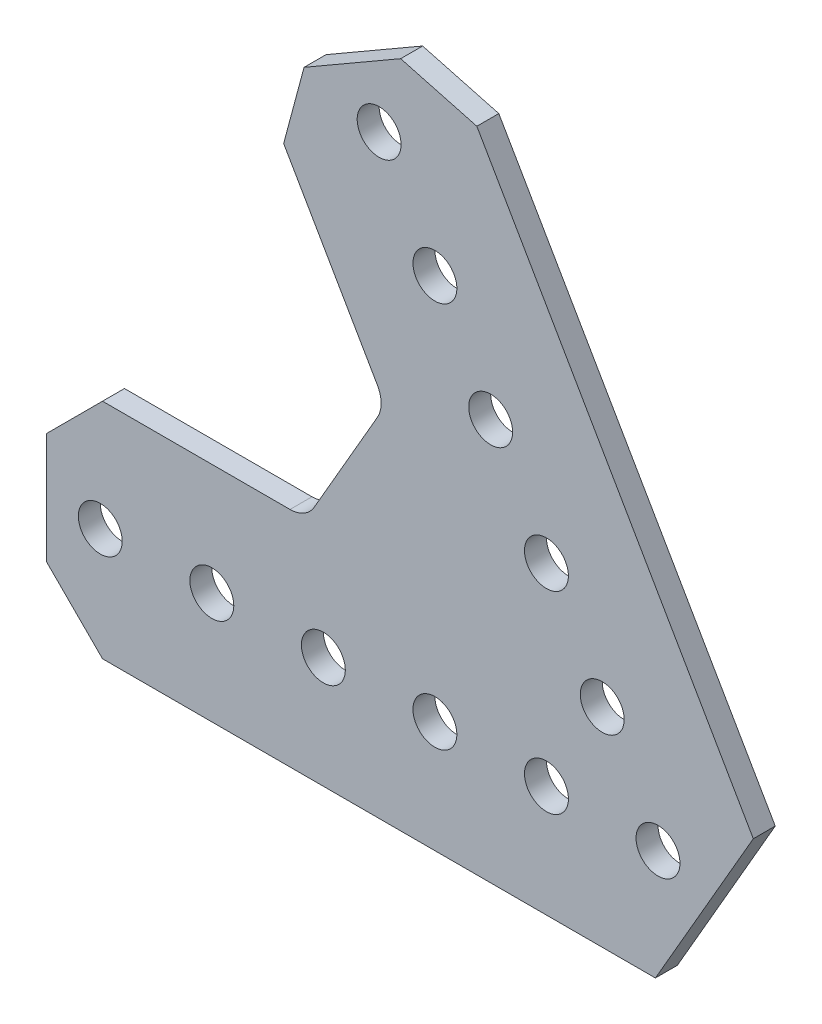
ISO-10303-21;
HEADER;
FILE_DESCRIPTION(('STEP AP214'),'2;1');
FILE_NAME('part.step','',(''),(''),'','','');
FILE_SCHEMA(('AUTOMOTIVE_DESIGN { 1 0 10303 214 1 1 1 1 }'));
ENDSEC;
DATA;
#1=APPLICATION_CONTEXT('core data for automotive mechanical design processes');
#2=APPLICATION_PROTOCOL_DEFINITION('international standard','automotive_design',2000,#1);
#3=PRODUCT_CONTEXT('',#1,'mechanical');
#4=PRODUCT('Part','Part','',(#3));
#5=PRODUCT_RELATED_PRODUCT_CATEGORY('part','',(#4));
#6=PRODUCT_DEFINITION_FORMATION('','',#4);
#7=PRODUCT_DEFINITION_CONTEXT('part definition',#1,'design');
#8=PRODUCT_DEFINITION('design','',#6,#7);
#9=PRODUCT_DEFINITION_SHAPE('','',#8);
#10=(LENGTH_UNIT() NAMED_UNIT(*) SI_UNIT(.MILLI.,.METRE.));
#11=(NAMED_UNIT(*) PLANE_ANGLE_UNIT() SI_UNIT($,.RADIAN.));
#12=(NAMED_UNIT(*) SI_UNIT($,.STERADIAN.) SOLID_ANGLE_UNIT());
#13=UNCERTAINTY_MEASURE_WITH_UNIT(LENGTH_MEASURE(1.E-05),#10,'distance_accuracy_value','');
#14=(GEOMETRIC_REPRESENTATION_CONTEXT(3) GLOBAL_UNCERTAINTY_ASSIGNED_CONTEXT((#13)) GLOBAL_UNIT_ASSIGNED_CONTEXT((#10,
#11,#12)) REPRESENTATION_CONTEXT('',''));
#15=CARTESIAN_POINT('',(0.,0.,0.));
#16=DIRECTION('',(0.,0.,1.));
#17=DIRECTION('',(1.,0.,0.));
#18=AXIS2_PLACEMENT_3D('',#15,#16,#17);
#19=CARTESIAN_POINT('',(10.8518756596882,6.604,1.25));
#20=DIRECTION('',(0.866025403784439,-0.499999999999999,0.));
#21=DIRECTION('',(0.499999999999999,0.866025403784439,0.));
#22=AXIS2_PLACEMENT_3D('',#19,#20,#21);
#23=PLANE('',#22);
#24=DIRECTION('',(-0.499999999999999,-0.866025403784439,0.));
#25=VECTOR('',#24,1.);
#26=CARTESIAN_POINT('',(10.8518756596882,6.604,-1.25));
#27=LINE('',#26,#25);
#28=CARTESIAN_POINT('',(10.8518756596882,6.604,-1.25));
#29=VERTEX_POINT('',#28);
#30=CARTESIAN_POINT('',(-0.293293936748299,-12.7,-1.25));
#31=VERTEX_POINT('',#30);
#32=EDGE_CURVE('E184',#29,#31,#27,.T.);
#33=ORIENTED_EDGE('',*,*,#32,.F.);
#34=DIRECTION('',(0.,0.,-1.));
#35=VECTOR('',#34,1.);
#36=CARTESIAN_POINT('',(10.8518756596882,6.604,1.25));
#37=LINE('',#36,#35);
#38=CARTESIAN_POINT('',(10.8518756596882,6.604,1.25));
#39=VERTEX_POINT('',#38);
#40=EDGE_CURVE('E11',#39,#29,#37,.T.);
#41=ORIENTED_EDGE('',*,*,#40,.F.);
#42=DIRECTION('',(-0.499999999999999,-0.866025403784439,0.));
#43=VECTOR('',#42,1.);
#44=CARTESIAN_POINT('',(10.8518756596882,6.604,1.25));
#45=LINE('',#44,#43);
#46=CARTESIAN_POINT('',(-0.293293936748299,-12.7,1.25));
#47=VERTEX_POINT('',#46);
#48=EDGE_CURVE('E237',#39,#47,#45,.T.);
#49=ORIENTED_EDGE('',*,*,#48,.T.);
#50=DIRECTION('',(0.,0.,-1.));
#51=VECTOR('',#50,1.);
#52=CARTESIAN_POINT('',(-0.293293936748299,-12.7,1.25));
#53=LINE('',#52,#51);
#54=EDGE_CURVE('E48',#47,#31,#53,.T.);
#55=ORIENTED_EDGE('',*,*,#54,.T.);
#56=EDGE_LOOP('',(#33,#41,#49,#55));
#57=FACE_BOUND('',#56,.T.);
#58=ADVANCED_FACE('F45',(#57),#23,.T.);
#59=CARTESIAN_POINT('',(-20.624477371938,61.1226426877505,1.25));
#60=DIRECTION('',(0.866025403784436,0.500000000000004,0.));
#61=DIRECTION('',(-0.500000000000005,0.866025403784436,0.));
#62=AXIS2_PLACEMENT_3D('',#59,#60,#61);
#63=PLANE('',#62);
#64=DIRECTION('',(0.500000000000004,-0.866025403784436,0.));
#65=VECTOR('',#64,1.);
#66=CARTESIAN_POINT('',(-20.624477371938,61.1226426877505,-1.25));
#67=LINE('',#66,#65);
#68=CARTESIAN_POINT('',(-20.624477371938,61.1226426877505,-1.25));
#69=VERTEX_POINT('',#68);
#70=EDGE_CURVE('E234',#69,#29,#67,.T.);
#71=ORIENTED_EDGE('',*,*,#70,.F.);
#72=DIRECTION('',(0.,0.,-1.));
#73=VECTOR('',#72,1.);
#74=CARTESIAN_POINT('',(-20.624477371938,61.1226426877505,1.25));
#75=LINE('',#74,#73);
#76=CARTESIAN_POINT('',(-20.624477371938,61.1226426877505,1.25));
#77=VERTEX_POINT('',#76);
#78=EDGE_CURVE('E55',#77,#69,#75,.T.);
#79=ORIENTED_EDGE('',*,*,#78,.F.);
#80=DIRECTION('',(0.500000000000004,-0.866025403784436,0.));
#81=VECTOR('',#80,1.);
#82=CARTESIAN_POINT('',(-20.624477371938,61.1226426877505,1.25));
#83=LINE('',#82,#81);
#84=EDGE_CURVE('E170',#77,#39,#83,.T.);
#85=ORIENTED_EDGE('',*,*,#84,.T.);
#86=ORIENTED_EDGE('',*,*,#40,.T.);
#87=EDGE_LOOP('',(#71,#79,#85,#86));
#88=FACE_BOUND('',#87,.T.);
#89=ADVANCED_FACE('F273',(#88),#63,.T.);
#90=CARTESIAN_POINT('',(-29.2987386859691,63.4469040017817,1.25));
#91=DIRECTION('',(0.258819045102523,0.965925826289068,0.));
#92=DIRECTION('',(-0.965925826289068,0.258819045102523,0.));
#93=AXIS2_PLACEMENT_3D('',#90,#91,#92);
#94=PLANE('',#93);
#95=DIRECTION('',(0.965925826289068,-0.258819045102523,0.));
#96=VECTOR('',#95,1.);
#97=CARTESIAN_POINT('',(-29.2987386859691,63.4469040017817,-1.25));
#98=LINE('',#97,#96);
#99=CARTESIAN_POINT('',(-29.2987386859691,63.4469040017817,-1.25));
#100=VERTEX_POINT('',#99);
#101=EDGE_CURVE('E156',#100,#69,#98,.T.);
#102=ORIENTED_EDGE('',*,*,#101,.F.);
#103=DIRECTION('',(0.,0.,-1.));
#104=VECTOR('',#103,1.);
#105=CARTESIAN_POINT('',(-29.2987386859691,63.4469040017817,1.25));
#106=LINE('',#105,#104);
#107=CARTESIAN_POINT('',(-29.2987386859691,63.4469040017817,1.25));
#108=VERTEX_POINT('',#107);
#109=EDGE_CURVE('E151',#108,#100,#106,.T.);
#110=ORIENTED_EDGE('',*,*,#109,.F.);
#111=DIRECTION('',(0.965925826289068,-0.258819045102523,0.));
#112=VECTOR('',#111,1.);
#113=CARTESIAN_POINT('',(-29.2987386859691,63.4469040017817,1.25));
#114=LINE('',#113,#112);
#115=EDGE_CURVE('E154',#108,#77,#114,.T.);
#116=ORIENTED_EDGE('',*,*,#115,.T.);
#117=ORIENTED_EDGE('',*,*,#78,.T.);
#118=EDGE_LOOP('',(#102,#110,#116,#117));
#119=FACE_BOUND('',#118,.T.);
#120=ADVANCED_FACE('F153',(#119),#94,.T.);
#121=CARTESIAN_POINT('',(-40.2972613140314,57.0969040017816,1.25));
#122=DIRECTION('',(-0.500000000000007,0.866025403784435,0.));
#123=DIRECTION('',(-0.866025403784435,-0.500000000000007,0.));
#124=AXIS2_PLACEMENT_3D('',#121,#122,#123);
#125=PLANE('',#124);
#126=DIRECTION('',(0.866025403784435,0.500000000000007,0.));
#127=VECTOR('',#126,1.);
#128=CARTESIAN_POINT('',(-40.2972613140314,57.0969040017816,-1.25));
#129=LINE('',#128,#127);
#130=CARTESIAN_POINT('',(-40.2972613140314,57.0969040017816,-1.25));
#131=VERTEX_POINT('',#130);
#132=EDGE_CURVE('E229',#131,#100,#129,.T.);
#133=ORIENTED_EDGE('',*,*,#132,.F.);
#134=DIRECTION('',(0.,0.,-1.));
#135=VECTOR('',#134,1.);
#136=CARTESIAN_POINT('',(-40.2972613140314,57.0969040017816,1.25));
#137=LINE('',#136,#135);
#138=CARTESIAN_POINT('',(-40.2972613140314,57.0969040017816,1.25));
#139=VERTEX_POINT('',#138);
#140=EDGE_CURVE('E162',#139,#131,#137,.T.);
#141=ORIENTED_EDGE('',*,*,#140,.F.);
#142=DIRECTION('',(0.866025403784435,0.500000000000007,0.));
#143=VECTOR('',#142,1.);
#144=CARTESIAN_POINT('',(-40.2972613140314,57.0969040017816,1.25));
#145=LINE('',#144,#143);
#146=EDGE_CURVE('E168',#139,#108,#145,.T.);
#147=ORIENTED_EDGE('',*,*,#146,.T.);
#148=ORIENTED_EDGE('',*,*,#109,.T.);
#149=EDGE_LOOP('',(#133,#141,#147,#148));
#150=FACE_BOUND('',#149,.T.);
#151=ADVANCED_FACE('F173',(#150),#125,.T.);
#152=CARTESIAN_POINT('',(-42.6215226280626,48.4226426877505,1.25));
#153=DIRECTION('',(-0.965925826289069,0.25881904510252,0.));
#154=DIRECTION('',(-0.25881904510252,-0.965925826289069,0.));
#155=AXIS2_PLACEMENT_3D('',#152,#153,#154);
#156=PLANE('',#155);
#157=DIRECTION('',(0.25881904510252,0.965925826289069,0.));
#158=VECTOR('',#157,1.);
#159=CARTESIAN_POINT('',(-42.6215226280626,48.4226426877505,-1.25));
#160=LINE('',#159,#158);
#161=CARTESIAN_POINT('',(-42.6215226280626,48.4226426877505,-1.25));
#162=VERTEX_POINT('',#161);
#163=EDGE_CURVE('E225',#162,#131,#160,.T.);
#164=ORIENTED_EDGE('',*,*,#163,.F.);
#165=DIRECTION('',(0.,0.,-1.));
#166=VECTOR('',#165,1.);
#167=CARTESIAN_POINT('',(-42.6215226280626,48.4226426877505,1.25));
#168=LINE('',#167,#166);
#169=CARTESIAN_POINT('',(-42.6215226280626,48.4226426877505,1.25));
#170=VERTEX_POINT('',#169);
#171=EDGE_CURVE('E243',#170,#162,#168,.T.);
#172=ORIENTED_EDGE('',*,*,#171,.F.);
#173=DIRECTION('',(0.25881904510252,0.965925826289069,0.));
#174=VECTOR('',#173,1.);
#175=CARTESIAN_POINT('',(-42.6215226280626,48.4226426877505,1.25));
#176=LINE('',#175,#174);
#177=EDGE_CURVE('E175',#170,#139,#176,.T.);
#178=ORIENTED_EDGE('',*,*,#177,.T.);
#179=ORIENTED_EDGE('',*,*,#140,.T.);
#180=EDGE_LOOP('',(#164,#172,#178,#179));
#181=FACE_BOUND('',#180,.T.);
#182=ADVANCED_FACE('F286',(#181),#156,.T.);
#183=CARTESIAN_POINT('',(-31.9474145991094,29.9345452561247,1.25));
#184=DIRECTION('',(-0.866025403784437,-0.500000000000002,0.));
#185=DIRECTION('',(0.500000000000002,-0.866025403784438,0.));
#186=AXIS2_PLACEMENT_3D('',#183,#184,#185);
#187=PLANE('',#186);
#188=DIRECTION('',(-0.500000000000002,0.866025403784437,0.));
#189=VECTOR('',#188,1.);
#190=CARTESIAN_POINT('',(-31.9474145991094,29.9345452561247,-1.25));
#191=LINE('',#190,#189);
#192=CARTESIAN_POINT('',(-31.9474145991094,29.9345452561247,-1.25));
#193=VERTEX_POINT('',#192);
#194=EDGE_CURVE('E221',#193,#162,#191,.T.);
#195=ORIENTED_EDGE('',*,*,#194,.F.);
#196=DIRECTION('',(0.,0.,-1.));
#197=VECTOR('',#196,1.);
#198=CARTESIAN_POINT('',(-31.9474145991094,29.9345452561247,1.25));
#199=LINE('',#198,#197);
#200=CARTESIAN_POINT('',(-31.9474145991094,29.9345452561247,1.25));
#201=VERTEX_POINT('',#200);
#202=EDGE_CURVE('E246',#201,#193,#199,.T.);
#203=ORIENTED_EDGE('',*,*,#202,.F.);
#204=DIRECTION('',(-0.500000000000002,0.866025403784437,0.));
#205=VECTOR('',#204,1.);
#206=CARTESIAN_POINT('',(-31.9474145991094,29.9345452561247,1.25));
#207=LINE('',#206,#205);
#208=EDGE_CURVE('E178',#201,#170,#207,.T.);
#209=ORIENTED_EDGE('',*,*,#208,.T.);
#210=ORIENTED_EDGE('',*,*,#171,.T.);
#211=EDGE_LOOP('',(#195,#203,#209,#210));
#212=FACE_BOUND('',#211,.T.);
#213=ADVANCED_FACE('F289',(#212),#187,.T.);
#214=CARTESIAN_POINT('',(-34.6970452561249,28.3470452561247,1.25));
#215=DIRECTION('',(0.,0.,-1.));
#216=DIRECTION('',(-1.,0.,0.));
#217=AXIS2_PLACEMENT_3D('',#214,#215,#216);
#218=CYLINDRICAL_SURFACE('',#217,3.17499999999999);
#219=CARTESIAN_POINT('',(-34.6970452561249,28.3470452561247,-1.25));
#220=DIRECTION('',(0.,0.,1.));
#221=DIRECTION('',(1.,0.,0.));
#222=AXIS2_PLACEMENT_3D('',#219,#220,#221);
#223=CIRCLE('',#222,3.17499999999999);
#224=CARTESIAN_POINT('',(-31.9474145991093,26.7595452561247,-1.25));
#225=VERTEX_POINT('',#224);
#226=EDGE_CURVE('E217',#225,#193,#223,.T.);
#227=ORIENTED_EDGE('',*,*,#226,.F.);
#228=DIRECTION('',(0.,0.,-1.));
#229=VECTOR('',#228,1.);
#230=CARTESIAN_POINT('',(-31.9474145991093,26.7595452561247,1.25));
#231=LINE('',#230,#229);
#232=CARTESIAN_POINT('',(-31.9474145991093,26.7595452561247,1.25));
#233=VERTEX_POINT('',#232);
#234=EDGE_CURVE('E249',#233,#225,#231,.T.);
#235=ORIENTED_EDGE('',*,*,#234,.F.);
#236=CARTESIAN_POINT('',(-34.6970452561249,28.3470452561247,1.25));
#237=DIRECTION('',(0.,0.,1.));
#238=DIRECTION('',(1.,0.,0.));
#239=AXIS2_PLACEMENT_3D('',#236,#237,#238);
#240=CIRCLE('',#239,3.17499999999999);
#241=EDGE_CURVE('E497',#233,#201,#240,.T.);
#242=ORIENTED_EDGE('',*,*,#241,.T.);
#243=ORIENTED_EDGE('',*,*,#202,.T.);
#244=EDGE_LOOP('',(#227,#235,#242,#243));
#245=FACE_BOUND('',#244,.T.);
#246=ADVANCED_FACE('F293',(#245),#218,.F.);
#247=CARTESIAN_POINT('',(-39.148153285078,14.2875,1.25));
#248=DIRECTION('',(-0.866025403784441,0.499999999999996,0.));
#249=DIRECTION('',(-0.499999999999996,-0.866025403784441,0.));
#250=AXIS2_PLACEMENT_3D('',#247,#248,#249);
#251=PLANE('',#250);
#252=DIRECTION('',(0.499999999999996,0.866025403784441,0.));
#253=VECTOR('',#252,1.);
#254=CARTESIAN_POINT('',(-39.148153285078,14.2875,-1.25));
#255=LINE('',#254,#253);
#256=CARTESIAN_POINT('',(-39.148153285078,14.2875,-1.25));
#257=VERTEX_POINT('',#256);
#258=EDGE_CURVE('E213',#257,#225,#255,.T.);
#259=ORIENTED_EDGE('',*,*,#258,.F.);
#260=DIRECTION('',(0.,0.,-1.));
#261=VECTOR('',#260,1.);
#262=CARTESIAN_POINT('',(-39.148153285078,14.2875,1.25));
#263=LINE('',#262,#261);
#264=CARTESIAN_POINT('',(-39.148153285078,14.2875,1.25));
#265=VERTEX_POINT('',#264);
#266=EDGE_CURVE('E252',#265,#257,#263,.T.);
#267=ORIENTED_EDGE('',*,*,#266,.F.);
#268=DIRECTION('',(0.499999999999996,0.866025403784441,0.));
#269=VECTOR('',#268,1.);
#270=CARTESIAN_POINT('',(-39.148153285078,14.2875,1.25));
#271=LINE('',#270,#269);
#272=EDGE_CURVE('E493',#265,#233,#271,.T.);
#273=ORIENTED_EDGE('',*,*,#272,.T.);
#274=ORIENTED_EDGE('',*,*,#234,.T.);
#275=EDGE_LOOP('',(#259,#267,#273,#274));
#276=FACE_BOUND('',#275,.T.);
#277=ADVANCED_FACE('F297',(#276),#251,.T.);
#278=CARTESIAN_POINT('',(-41.8977839420936,15.875,1.25));
#279=DIRECTION('',(0.,0.,-1.));
#280=DIRECTION('',(-1.,0.,0.));
#281=AXIS2_PLACEMENT_3D('',#278,#279,#280);
#282=CYLINDRICAL_SURFACE('',#281,3.175);
#283=CARTESIAN_POINT('',(-41.8977839420936,15.875,-1.25));
#284=DIRECTION('',(0.,0.,1.));
#285=DIRECTION('',(1.,0.,0.));
#286=AXIS2_PLACEMENT_3D('',#283,#284,#285);
#287=CIRCLE('',#286,3.175);
#288=CARTESIAN_POINT('',(-41.8977839420936,12.7,-1.25));
#289=VERTEX_POINT('',#288);
#290=EDGE_CURVE('E209',#289,#257,#287,.T.);
#291=ORIENTED_EDGE('',*,*,#290,.F.);
#292=DIRECTION('',(0.,0.,-1.));
#293=VECTOR('',#292,1.);
#294=CARTESIAN_POINT('',(-41.8977839420936,12.7,1.25));
#295=LINE('',#294,#293);
#296=CARTESIAN_POINT('',(-41.8977839420936,12.7,1.25));
#297=VERTEX_POINT('',#296);
#298=EDGE_CURVE('E255',#297,#289,#295,.T.);
#299=ORIENTED_EDGE('',*,*,#298,.F.);
#300=CARTESIAN_POINT('',(-41.8977839420936,15.875,1.25));
#301=DIRECTION('',(0.,0.,1.));
#302=DIRECTION('',(1.,0.,0.));
#303=AXIS2_PLACEMENT_3D('',#300,#301,#302);
#304=CIRCLE('',#303,3.175);
#305=EDGE_CURVE('E489',#297,#265,#304,.T.);
#306=ORIENTED_EDGE('',*,*,#305,.T.);
#307=ORIENTED_EDGE('',*,*,#266,.T.);
#308=EDGE_LOOP('',(#291,#299,#306,#307));
#309=FACE_BOUND('',#308,.T.);
#310=ADVANCED_FACE('F301',(#309),#282,.F.);
#311=CARTESIAN_POINT('',(-63.246,12.7,1.25));
#312=DIRECTION('',(0.,1.,0.));
#313=DIRECTION('',(0.,0.,1.));
#314=AXIS2_PLACEMENT_3D('',#311,#312,#313);
#315=PLANE('',#314);
#316=DIRECTION('',(1.,0.,0.));
#317=VECTOR('',#316,1.);
#318=CARTESIAN_POINT('',(-63.246,12.7,-1.25));
#319=LINE('',#318,#317);
#320=CARTESIAN_POINT('',(-63.246,12.7,-1.25));
#321=VERTEX_POINT('',#320);
#322=EDGE_CURVE('E205',#321,#289,#319,.T.);
#323=ORIENTED_EDGE('',*,*,#322,.F.);
#324=DIRECTION('',(0.,0.,-1.));
#325=VECTOR('',#324,1.);
#326=CARTESIAN_POINT('',(-63.246,12.7,1.25));
#327=LINE('',#326,#325);
#328=CARTESIAN_POINT('',(-63.246,12.7,1.25));
#329=VERTEX_POINT('',#328);
#330=EDGE_CURVE('E258',#329,#321,#327,.T.);
#331=ORIENTED_EDGE('',*,*,#330,.F.);
#332=DIRECTION('',(1.,0.,0.));
#333=VECTOR('',#332,1.);
#334=CARTESIAN_POINT('',(-63.246,12.7,1.25));
#335=LINE('',#334,#333);
#336=EDGE_CURVE('E485',#329,#297,#335,.T.);
#337=ORIENTED_EDGE('',*,*,#336,.T.);
#338=ORIENTED_EDGE('',*,*,#298,.T.);
#339=EDGE_LOOP('',(#323,#331,#337,#338));
#340=FACE_BOUND('',#339,.T.);
#341=ADVANCED_FACE('F305',(#340),#315,.T.);
#342=CARTESIAN_POINT('',(-69.596,6.35,1.25));
#343=DIRECTION('',(-0.707106781186547,0.707106781186548,0.));
#344=DIRECTION('',(-0.707106781186548,-0.707106781186547,0.));
#345=AXIS2_PLACEMENT_3D('',#342,#343,#344);
#346=PLANE('',#345);
#347=DIRECTION('',(0.707106781186548,0.707106781186547,0.));
#348=VECTOR('',#347,1.);
#349=CARTESIAN_POINT('',(-69.596,6.35,-1.25));
#350=LINE('',#349,#348);
#351=CARTESIAN_POINT('',(-69.596,6.35,-1.25));
#352=VERTEX_POINT('',#351);
#353=EDGE_CURVE('E201',#352,#321,#350,.T.);
#354=ORIENTED_EDGE('',*,*,#353,.F.);
#355=DIRECTION('',(0.,0.,-1.));
#356=VECTOR('',#355,1.);
#357=CARTESIAN_POINT('',(-69.596,6.35,1.25));
#358=LINE('',#357,#356);
#359=CARTESIAN_POINT('',(-69.596,6.35,1.25));
#360=VERTEX_POINT('',#359);
#361=EDGE_CURVE('E261',#360,#352,#358,.T.);
#362=ORIENTED_EDGE('',*,*,#361,.F.);
#363=DIRECTION('',(0.707106781186548,0.707106781186547,0.));
#364=VECTOR('',#363,1.);
#365=CARTESIAN_POINT('',(-69.596,6.35,1.25));
#366=LINE('',#365,#364);
#367=EDGE_CURVE('E481',#360,#329,#366,.T.);
#368=ORIENTED_EDGE('',*,*,#367,.T.);
#369=ORIENTED_EDGE('',*,*,#330,.T.);
#370=EDGE_LOOP('',(#354,#362,#368,#369));
#371=FACE_BOUND('',#370,.T.);
#372=ADVANCED_FACE('F309',(#371),#346,.T.);
#373=CARTESIAN_POINT('',(-69.596,-6.35,1.25));
#374=DIRECTION('',(-1.,0.,0.));
#375=DIRECTION('',(0.,0.,1.));
#376=AXIS2_PLACEMENT_3D('',#373,#374,#375);
#377=PLANE('',#376);
#378=DIRECTION('',(0.,1.,0.));
#379=VECTOR('',#378,1.);
#380=CARTESIAN_POINT('',(-69.596,-6.35,-1.25));
#381=LINE('',#380,#379);
#382=CARTESIAN_POINT('',(-69.596,-6.35,-1.25));
#383=VERTEX_POINT('',#382);
#384=EDGE_CURVE('E197',#383,#352,#381,.T.);
#385=ORIENTED_EDGE('',*,*,#384,.F.);
#386=DIRECTION('',(0.,0.,-1.));
#387=VECTOR('',#386,1.);
#388=CARTESIAN_POINT('',(-69.596,-6.35,1.25));
#389=LINE('',#388,#387);
#390=CARTESIAN_POINT('',(-69.596,-6.35,1.25));
#391=VERTEX_POINT('',#390);
#392=EDGE_CURVE('E264',#391,#383,#389,.T.);
#393=ORIENTED_EDGE('',*,*,#392,.F.);
#394=DIRECTION('',(0.,1.,0.));
#395=VECTOR('',#394,1.);
#396=CARTESIAN_POINT('',(-69.596,-6.35,1.25));
#397=LINE('',#396,#395);
#398=EDGE_CURVE('E477',#391,#360,#397,.T.);
#399=ORIENTED_EDGE('',*,*,#398,.T.);
#400=ORIENTED_EDGE('',*,*,#361,.T.);
#401=EDGE_LOOP('',(#385,#393,#399,#400));
#402=FACE_BOUND('',#401,.T.);
#403=ADVANCED_FACE('F313',(#402),#377,.T.);
#404=CARTESIAN_POINT('',(-63.246,-12.7,1.25));
#405=DIRECTION('',(-0.707106781186547,-0.707106781186548,0.));
#406=DIRECTION('',(0.707106781186548,-0.707106781186547,0.));
#407=AXIS2_PLACEMENT_3D('',#404,#405,#406);
#408=PLANE('',#407);
#409=DIRECTION('',(-0.707106781186548,0.707106781186547,0.));
#410=VECTOR('',#409,1.);
#411=CARTESIAN_POINT('',(-63.246,-12.7,-1.25));
#412=LINE('',#411,#410);
#413=CARTESIAN_POINT('',(-63.246,-12.7,-1.25));
#414=VERTEX_POINT('',#413);
#415=EDGE_CURVE('E193',#414,#383,#412,.T.);
#416=ORIENTED_EDGE('',*,*,#415,.F.);
#417=DIRECTION('',(0.,0.,-1.));
#418=VECTOR('',#417,1.);
#419=CARTESIAN_POINT('',(-63.246,-12.7,1.25));
#420=LINE('',#419,#418);
#421=CARTESIAN_POINT('',(-63.246,-12.7,1.25));
#422=VERTEX_POINT('',#421);
#423=EDGE_CURVE('E266',#422,#414,#420,.T.);
#424=ORIENTED_EDGE('',*,*,#423,.F.);
#425=DIRECTION('',(-0.707106781186548,0.707106781186547,0.));
#426=VECTOR('',#425,1.);
#427=CARTESIAN_POINT('',(-63.246,-12.7,1.25));
#428=LINE('',#427,#426);
#429=EDGE_CURVE('E473',#422,#391,#428,.T.);
#430=ORIENTED_EDGE('',*,*,#429,.T.);
#431=ORIENTED_EDGE('',*,*,#392,.T.);
#432=EDGE_LOOP('',(#416,#424,#430,#431));
#433=FACE_BOUND('',#432,.T.);
#434=ADVANCED_FACE('F317',(#433),#408,.T.);
#435=CARTESIAN_POINT('',(-0.293293936748299,-12.7,1.25));
#436=DIRECTION('',(0.,-1.,0.));
#437=DIRECTION('',(0.,0.,-1.));
#438=AXIS2_PLACEMENT_3D('',#435,#436,#437);
#439=PLANE('',#438);
#440=DIRECTION('',(-1.,0.,0.));
#441=VECTOR('',#440,1.);
#442=CARTESIAN_POINT('',(-0.293293936748299,-12.7,-1.25));
#443=LINE('',#442,#441);
#444=EDGE_CURVE('E188',#31,#414,#443,.T.);
#445=ORIENTED_EDGE('',*,*,#444,.F.);
#446=ORIENTED_EDGE('',*,*,#54,.F.);
#447=DIRECTION('',(-1.,0.,0.));
#448=VECTOR('',#447,1.);
#449=CARTESIAN_POINT('',(-0.293293936748299,-12.7,1.25));
#450=LINE('',#449,#448);
#451=EDGE_CURVE('E470',#47,#422,#450,.T.);
#452=ORIENTED_EDGE('',*,*,#451,.T.);
#453=ORIENTED_EDGE('',*,*,#423,.T.);
#454=EDGE_LOOP('',(#445,#446,#452,#453));
#455=FACE_BOUND('',#454,.T.);
#456=ADVANCED_FACE('F270',(#455),#439,.T.);
#457=CARTESIAN_POINT('',(-41.8977839420936,15.875,1.25));
#458=DIRECTION('',(0.,0.,1.));
#459=DIRECTION('',(1.,0.,0.));
#460=AXIS2_PLACEMENT_3D('',#457,#458,#459);
#461=PLANE('',#460);
#462=CARTESIAN_POINT('',(-6.3499999999998,10.9985226280625,1.25));
#463=DIRECTION('',(0.,0.,-1.));
#464=DIRECTION('',(1.,0.,0.));
#465=AXIS2_PLACEMENT_3D('',#462,#463,#464);
#466=CIRCLE('',#465,2.5);
#467=CARTESIAN_POINT('',(-3.8499999999998,10.9985226280625,1.25));
#468=VERTEX_POINT('',#467);
#469=EDGE_CURVE('E380',#468,#468,#466,.T.);
#470=ORIENTED_EDGE('',*,*,#469,.T.);
#471=EDGE_LOOP('',(#470));
#472=FACE_BOUND('',#471,.T.);
#473=CARTESIAN_POINT('',(-12.6999999999998,21.9970452561248,1.25));
#474=DIRECTION('',(0.,0.,-1.));
#475=DIRECTION('',(1.,0.,0.));
#476=AXIS2_PLACEMENT_3D('',#473,#474,#475);
#477=CIRCLE('',#476,2.5);
#478=CARTESIAN_POINT('',(-10.1999999999998,21.9970452561248,1.25));
#479=VERTEX_POINT('',#478);
#480=EDGE_CURVE('E390',#479,#479,#477,.T.);
#481=ORIENTED_EDGE('',*,*,#480,.T.);
#482=EDGE_LOOP('',(#481));
#483=FACE_BOUND('',#482,.T.);
#484=CARTESIAN_POINT('',(-19.05,32.9955678841872,1.25));
#485=DIRECTION('',(0.,0.,-1.));
#486=DIRECTION('',(1.,0.,0.));
#487=AXIS2_PLACEMENT_3D('',#484,#485,#486);
#488=CIRCLE('',#487,2.5);
#489=CARTESIAN_POINT('',(-16.55,32.9955678841872,1.25));
#490=VERTEX_POINT('',#489);
#491=EDGE_CURVE('E398',#490,#490,#488,.T.);
#492=ORIENTED_EDGE('',*,*,#491,.T.);
#493=EDGE_LOOP('',(#492));
#494=FACE_BOUND('',#493,.T.);
#495=CARTESIAN_POINT('',(-25.4,43.9940905122495,1.25));
#496=DIRECTION('',(0.,0.,-1.));
#497=DIRECTION('',(1.,0.,0.));
#498=AXIS2_PLACEMENT_3D('',#495,#496,#497);
#499=CIRCLE('',#498,2.5);
#500=CARTESIAN_POINT('',(-22.9,43.9940905122495,1.25));
#501=VERTEX_POINT('',#500);
#502=EDGE_CURVE('E406',#501,#501,#499,.T.);
#503=ORIENTED_EDGE('',*,*,#502,.T.);
#504=EDGE_LOOP('',(#503));
#505=FACE_BOUND('',#504,.T.);
#506=CARTESIAN_POINT('',(-31.75,54.9926131403119,1.25));
#507=DIRECTION('',(0.,0.,-1.));
#508=DIRECTION('',(1.,0.,0.));
#509=AXIS2_PLACEMENT_3D('',#506,#507,#508);
#510=CIRCLE('',#509,2.5);
#511=CARTESIAN_POINT('',(-29.25,54.9926131403119,1.25));
#512=VERTEX_POINT('',#511);
#513=EDGE_CURVE('E414',#512,#512,#510,.T.);
#514=ORIENTED_EDGE('',*,*,#513,.T.);
#515=EDGE_LOOP('',(#514));
#516=FACE_BOUND('',#515,.T.);
#517=CARTESIAN_POINT('',(-50.8,0.,1.25));
#518=DIRECTION('',(0.,0.,-1.));
#519=DIRECTION('',(1.,0.,0.));
#520=AXIS2_PLACEMENT_3D('',#517,#518,#519);
#521=CIRCLE('',#520,2.5);
#522=CARTESIAN_POINT('',(-48.3,0.,1.25));
#523=VERTEX_POINT('',#522);
#524=EDGE_CURVE('E422',#523,#523,#521,.T.);
#525=ORIENTED_EDGE('',*,*,#524,.T.);
#526=EDGE_LOOP('',(#525));
#527=FACE_BOUND('',#526,.T.);
#528=CARTESIAN_POINT('',(-63.5,0.,1.25));
#529=DIRECTION('',(0.,0.,-1.));
#530=DIRECTION('',(1.,0.,0.));
#531=AXIS2_PLACEMENT_3D('',#528,#529,#530);
#532=CIRCLE('',#531,2.5);
#533=CARTESIAN_POINT('',(-61.,0.,1.25));
#534=VERTEX_POINT('',#533);
#535=EDGE_CURVE('E430',#534,#534,#532,.T.);
#536=ORIENTED_EDGE('',*,*,#535,.T.);
#537=EDGE_LOOP('',(#536));
#538=FACE_BOUND('',#537,.T.);
#539=CARTESIAN_POINT('',(0.,0.,1.25));
#540=DIRECTION('',(0.,0.,-1.));
#541=DIRECTION('',(1.,0.,0.));
#542=AXIS2_PLACEMENT_3D('',#539,#540,#541);
#543=CIRCLE('',#542,2.5);
#544=CARTESIAN_POINT('',(2.5,0.,1.25));
#545=VERTEX_POINT('',#544);
#546=EDGE_CURVE('E438',#545,#545,#543,.T.);
#547=ORIENTED_EDGE('',*,*,#546,.T.);
#548=EDGE_LOOP('',(#547));
#549=FACE_BOUND('',#548,.T.);
#550=CARTESIAN_POINT('',(-38.1,0.,1.25));
#551=DIRECTION('',(0.,0.,-1.));
#552=DIRECTION('',(1.,0.,0.));
#553=AXIS2_PLACEMENT_3D('',#550,#551,#552);
#554=CIRCLE('',#553,2.5);
#555=CARTESIAN_POINT('',(-35.6,0.,1.25));
#556=VERTEX_POINT('',#555);
#557=EDGE_CURVE('E446',#556,#556,#554,.T.);
#558=ORIENTED_EDGE('',*,*,#557,.T.);
#559=EDGE_LOOP('',(#558));
#560=FACE_BOUND('',#559,.T.);
#561=CARTESIAN_POINT('',(-25.4,0.,1.25));
#562=DIRECTION('',(0.,0.,-1.));
#563=DIRECTION('',(1.,0.,0.));
#564=AXIS2_PLACEMENT_3D('',#561,#562,#563);
#565=CIRCLE('',#564,2.5);
#566=CARTESIAN_POINT('',(-22.9,0.,1.25));
#567=VERTEX_POINT('',#566);
#568=EDGE_CURVE('E454',#567,#567,#565,.T.);
#569=ORIENTED_EDGE('',*,*,#568,.T.);
#570=EDGE_LOOP('',(#569));
#571=FACE_BOUND('',#570,.T.);
#572=CARTESIAN_POINT('',(-12.7,0.,1.25));
#573=DIRECTION('',(0.,0.,-1.));
#574=DIRECTION('',(1.,0.,0.));
#575=AXIS2_PLACEMENT_3D('',#572,#573,#574);
#576=CIRCLE('',#575,2.5);
#577=CARTESIAN_POINT('',(-10.2,0.,1.25));
#578=VERTEX_POINT('',#577);
#579=EDGE_CURVE('E189',#578,#578,#576,.T.);
#580=ORIENTED_EDGE('',*,*,#579,.T.);
#581=EDGE_LOOP('',(#580));
#582=FACE_BOUND('',#581,.T.);
#583=ORIENTED_EDGE('',*,*,#48,.F.);
#584=ORIENTED_EDGE('',*,*,#84,.F.);
#585=ORIENTED_EDGE('',*,*,#115,.F.);
#586=ORIENTED_EDGE('',*,*,#146,.F.);
#587=ORIENTED_EDGE('',*,*,#177,.F.);
#588=ORIENTED_EDGE('',*,*,#208,.F.);
#589=ORIENTED_EDGE('',*,*,#241,.F.);
#590=ORIENTED_EDGE('',*,*,#272,.F.);
#591=ORIENTED_EDGE('',*,*,#305,.F.);
#592=ORIENTED_EDGE('',*,*,#336,.F.);
#593=ORIENTED_EDGE('',*,*,#367,.F.);
#594=ORIENTED_EDGE('',*,*,#398,.F.);
#595=ORIENTED_EDGE('',*,*,#429,.F.);
#596=ORIENTED_EDGE('',*,*,#451,.F.);
#597=EDGE_LOOP('',(#583,#584,#585,#586,#587,#588,#589,#590,#591,#592,#593,#594,#595,#596));
#598=FACE_BOUND('',#597,.T.);
#599=ADVANCED_FACE('F166',(#472,#483,#494,#505,#516,#527,#538,#549,#560,#571,#582,#598),#461,.T.);
#600=CARTESIAN_POINT('',(-41.8977839420936,15.875,-1.25));
#601=DIRECTION('',(0.,0.,1.));
#602=DIRECTION('',(1.,0.,0.));
#603=AXIS2_PLACEMENT_3D('',#600,#601,#602);
#604=PLANE('',#603);
#605=CARTESIAN_POINT('',(-6.3499999999998,10.9985226280625,-1.25));
#606=DIRECTION('',(0.,0.,-1.));
#607=DIRECTION('',(1.,0.,0.));
#608=AXIS2_PLACEMENT_3D('',#605,#606,#607);
#609=CIRCLE('',#608,2.5);
#610=CARTESIAN_POINT('',(-3.8499999999998,10.9985226280625,-1.25));
#611=VERTEX_POINT('',#610);
#612=EDGE_CURVE('E383',#611,#611,#609,.T.);
#613=ORIENTED_EDGE('',*,*,#612,.F.);
#614=EDGE_LOOP('',(#613));
#615=FACE_BOUND('',#614,.T.);
#616=CARTESIAN_POINT('',(-12.6999999999998,21.9970452561248,-1.25));
#617=DIRECTION('',(0.,0.,-1.));
#618=DIRECTION('',(1.,0.,0.));
#619=AXIS2_PLACEMENT_3D('',#616,#617,#618);
#620=CIRCLE('',#619,2.5);
#621=CARTESIAN_POINT('',(-10.1999999999998,21.9970452561248,-1.25));
#622=VERTEX_POINT('',#621);
#623=EDGE_CURVE('E387',#622,#622,#620,.T.);
#624=ORIENTED_EDGE('',*,*,#623,.F.);
#625=EDGE_LOOP('',(#624));
#626=FACE_BOUND('',#625,.T.);
#627=CARTESIAN_POINT('',(-19.05,32.9955678841872,-1.25));
#628=DIRECTION('',(0.,0.,-1.));
#629=DIRECTION('',(1.,0.,0.));
#630=AXIS2_PLACEMENT_3D('',#627,#628,#629);
#631=CIRCLE('',#630,2.5);
#632=CARTESIAN_POINT('',(-16.55,32.9955678841872,-1.25));
#633=VERTEX_POINT('',#632);
#634=EDGE_CURVE('E394',#633,#633,#631,.T.);
#635=ORIENTED_EDGE('',*,*,#634,.F.);
#636=EDGE_LOOP('',(#635));
#637=FACE_BOUND('',#636,.T.);
#638=CARTESIAN_POINT('',(-25.4,43.9940905122495,-1.25));
#639=DIRECTION('',(0.,0.,-1.));
#640=DIRECTION('',(1.,0.,0.));
#641=AXIS2_PLACEMENT_3D('',#638,#639,#640);
#642=CIRCLE('',#641,2.5);
#643=CARTESIAN_POINT('',(-22.9,43.9940905122495,-1.25));
#644=VERTEX_POINT('',#643);
#645=EDGE_CURVE('E402',#644,#644,#642,.T.);
#646=ORIENTED_EDGE('',*,*,#645,.F.);
#647=EDGE_LOOP('',(#646));
#648=FACE_BOUND('',#647,.T.);
#649=CARTESIAN_POINT('',(-31.75,54.9926131403119,-1.25));
#650=DIRECTION('',(0.,0.,-1.));
#651=DIRECTION('',(1.,0.,0.));
#652=AXIS2_PLACEMENT_3D('',#649,#650,#651);
#653=CIRCLE('',#652,2.5);
#654=CARTESIAN_POINT('',(-29.25,54.9926131403119,-1.25));
#655=VERTEX_POINT('',#654);
#656=EDGE_CURVE('E410',#655,#655,#653,.T.);
#657=ORIENTED_EDGE('',*,*,#656,.F.);
#658=EDGE_LOOP('',(#657));
#659=FACE_BOUND('',#658,.T.);
#660=CARTESIAN_POINT('',(-50.8,0.,-1.25));
#661=DIRECTION('',(0.,0.,-1.));
#662=DIRECTION('',(1.,0.,0.));
#663=AXIS2_PLACEMENT_3D('',#660,#661,#662);
#664=CIRCLE('',#663,2.5);
#665=CARTESIAN_POINT('',(-48.3,0.,-1.25));
#666=VERTEX_POINT('',#665);
#667=EDGE_CURVE('E418',#666,#666,#664,.T.);
#668=ORIENTED_EDGE('',*,*,#667,.F.);
#669=EDGE_LOOP('',(#668));
#670=FACE_BOUND('',#669,.T.);
#671=CARTESIAN_POINT('',(-63.5,0.,-1.25));
#672=DIRECTION('',(0.,0.,-1.));
#673=DIRECTION('',(1.,0.,0.));
#674=AXIS2_PLACEMENT_3D('',#671,#672,#673);
#675=CIRCLE('',#674,2.5);
#676=CARTESIAN_POINT('',(-61.,0.,-1.25));
#677=VERTEX_POINT('',#676);
#678=EDGE_CURVE('E426',#677,#677,#675,.T.);
#679=ORIENTED_EDGE('',*,*,#678,.F.);
#680=EDGE_LOOP('',(#679));
#681=FACE_BOUND('',#680,.T.);
#682=CARTESIAN_POINT('',(0.,0.,-1.25));
#683=DIRECTION('',(0.,0.,-1.));
#684=DIRECTION('',(1.,0.,0.));
#685=AXIS2_PLACEMENT_3D('',#682,#683,#684);
#686=CIRCLE('',#685,2.5);
#687=CARTESIAN_POINT('',(2.5,0.,-1.25));
#688=VERTEX_POINT('',#687);
#689=EDGE_CURVE('E434',#688,#688,#686,.T.);
#690=ORIENTED_EDGE('',*,*,#689,.F.);
#691=EDGE_LOOP('',(#690));
#692=FACE_BOUND('',#691,.T.);
#693=CARTESIAN_POINT('',(-38.1,0.,-1.25));
#694=DIRECTION('',(0.,0.,-1.));
#695=DIRECTION('',(1.,0.,0.));
#696=AXIS2_PLACEMENT_3D('',#693,#694,#695);
#697=CIRCLE('',#696,2.5);
#698=CARTESIAN_POINT('',(-35.6,0.,-1.25));
#699=VERTEX_POINT('',#698);
#700=EDGE_CURVE('E442',#699,#699,#697,.T.);
#701=ORIENTED_EDGE('',*,*,#700,.F.);
#702=EDGE_LOOP('',(#701));
#703=FACE_BOUND('',#702,.T.);
#704=CARTESIAN_POINT('',(-25.4,0.,-1.25));
#705=DIRECTION('',(0.,0.,-1.));
#706=DIRECTION('',(1.,0.,0.));
#707=AXIS2_PLACEMENT_3D('',#704,#705,#706);
#708=CIRCLE('',#707,2.5);
#709=CARTESIAN_POINT('',(-22.9,0.,-1.25));
#710=VERTEX_POINT('',#709);
#711=EDGE_CURVE('E450',#710,#710,#708,.T.);
#712=ORIENTED_EDGE('',*,*,#711,.F.);
#713=EDGE_LOOP('',(#712));
#714=FACE_BOUND('',#713,.T.);
#715=CARTESIAN_POINT('',(-12.7,0.,-1.25));
#716=DIRECTION('',(0.,0.,-1.));
#717=DIRECTION('',(1.,0.,0.));
#718=AXIS2_PLACEMENT_3D('',#715,#716,#717);
#719=CIRCLE('',#718,2.5);
#720=CARTESIAN_POINT('',(-10.2,0.,-1.25));
#721=VERTEX_POINT('',#720);
#722=EDGE_CURVE('E458',#721,#721,#719,.T.);
#723=ORIENTED_EDGE('',*,*,#722,.F.);
#724=EDGE_LOOP('',(#723));
#725=FACE_BOUND('',#724,.T.);
#726=ORIENTED_EDGE('',*,*,#32,.T.);
#727=ORIENTED_EDGE('',*,*,#444,.T.);
#728=ORIENTED_EDGE('',*,*,#415,.T.);
#729=ORIENTED_EDGE('',*,*,#384,.T.);
#730=ORIENTED_EDGE('',*,*,#353,.T.);
#731=ORIENTED_EDGE('',*,*,#322,.T.);
#732=ORIENTED_EDGE('',*,*,#290,.T.);
#733=ORIENTED_EDGE('',*,*,#258,.T.);
#734=ORIENTED_EDGE('',*,*,#226,.T.);
#735=ORIENTED_EDGE('',*,*,#194,.T.);
#736=ORIENTED_EDGE('',*,*,#163,.T.);
#737=ORIENTED_EDGE('',*,*,#132,.T.);
#738=ORIENTED_EDGE('',*,*,#101,.T.);
#739=ORIENTED_EDGE('',*,*,#70,.T.);
#740=EDGE_LOOP('',(#726,#727,#728,#729,#730,#731,#732,#733,#734,#735,#736,#737,#738,#739));
#741=FACE_BOUND('',#740,.T.);
#742=ADVANCED_FACE('F272',(#615,#626,#637,#648,#659,#670,#681,#692,#703,#714,#725,#741),#604,.F.);
#743=CARTESIAN_POINT('',(-12.7,0.,1.25));
#744=DIRECTION('',(0.,0.,-1.));
#745=DIRECTION('',(-1.,0.,0.));
#746=AXIS2_PLACEMENT_3D('',#743,#744,#745);
#747=CYLINDRICAL_SURFACE('',#746,2.5);
#748=ORIENTED_EDGE('',*,*,#579,.F.);
#749=EDGE_LOOP('',(#748));
#750=FACE_BOUND('',#749,.T.);
#751=ORIENTED_EDGE('',*,*,#722,.T.);
#752=EDGE_LOOP('',(#751));
#753=FACE_BOUND('',#752,.T.);
#754=ADVANCED_FACE('F329',(#750,#753),#747,.F.);
#755=CARTESIAN_POINT('',(-25.4,0.,1.25));
#756=DIRECTION('',(0.,0.,-1.));
#757=DIRECTION('',(-1.,0.,0.));
#758=AXIS2_PLACEMENT_3D('',#755,#756,#757);
#759=CYLINDRICAL_SURFACE('',#758,2.5);
#760=ORIENTED_EDGE('',*,*,#568,.F.);
#761=EDGE_LOOP('',(#760));
#762=FACE_BOUND('',#761,.T.);
#763=ORIENTED_EDGE('',*,*,#711,.T.);
#764=EDGE_LOOP('',(#763));
#765=FACE_BOUND('',#764,.T.);
#766=ADVANCED_FACE('F336',(#762,#765),#759,.F.);
#767=CARTESIAN_POINT('',(-38.1,0.,1.25));
#768=DIRECTION('',(0.,0.,-1.));
#769=DIRECTION('',(-1.,0.,0.));
#770=AXIS2_PLACEMENT_3D('',#767,#768,#769);
#771=CYLINDRICAL_SURFACE('',#770,2.5);
#772=ORIENTED_EDGE('',*,*,#557,.F.);
#773=EDGE_LOOP('',(#772));
#774=FACE_BOUND('',#773,.T.);
#775=ORIENTED_EDGE('',*,*,#700,.T.);
#776=EDGE_LOOP('',(#775));
#777=FACE_BOUND('',#776,.T.);
#778=ADVANCED_FACE('F340',(#774,#777),#771,.F.);
#779=CARTESIAN_POINT('',(0.,0.,1.25));
#780=DIRECTION('',(0.,0.,-1.));
#781=DIRECTION('',(-1.,0.,0.));
#782=AXIS2_PLACEMENT_3D('',#779,#780,#781);
#783=CYLINDRICAL_SURFACE('',#782,2.5);
#784=ORIENTED_EDGE('',*,*,#546,.F.);
#785=EDGE_LOOP('',(#784));
#786=FACE_BOUND('',#785,.T.);
#787=ORIENTED_EDGE('',*,*,#689,.T.);
#788=EDGE_LOOP('',(#787));
#789=FACE_BOUND('',#788,.T.);
#790=ADVANCED_FACE('F344',(#786,#789),#783,.F.);
#791=CARTESIAN_POINT('',(-63.5,0.,1.25));
#792=DIRECTION('',(0.,0.,-1.));
#793=DIRECTION('',(-1.,0.,0.));
#794=AXIS2_PLACEMENT_3D('',#791,#792,#793);
#795=CYLINDRICAL_SURFACE('',#794,2.5);
#796=ORIENTED_EDGE('',*,*,#535,.F.);
#797=EDGE_LOOP('',(#796));
#798=FACE_BOUND('',#797,.T.);
#799=ORIENTED_EDGE('',*,*,#678,.T.);
#800=EDGE_LOOP('',(#799));
#801=FACE_BOUND('',#800,.T.);
#802=ADVANCED_FACE('F348',(#798,#801),#795,.F.);
#803=CARTESIAN_POINT('',(-50.8,0.,1.25));
#804=DIRECTION('',(0.,0.,-1.));
#805=DIRECTION('',(-1.,0.,0.));
#806=AXIS2_PLACEMENT_3D('',#803,#804,#805);
#807=CYLINDRICAL_SURFACE('',#806,2.5);
#808=ORIENTED_EDGE('',*,*,#524,.F.);
#809=EDGE_LOOP('',(#808));
#810=FACE_BOUND('',#809,.T.);
#811=ORIENTED_EDGE('',*,*,#667,.T.);
#812=EDGE_LOOP('',(#811));
#813=FACE_BOUND('',#812,.T.);
#814=ADVANCED_FACE('F352',(#810,#813),#807,.F.);
#815=CARTESIAN_POINT('',(-31.75,54.9926131403119,1.25));
#816=DIRECTION('',(0.,0.,-1.));
#817=DIRECTION('',(-1.,0.,0.));
#818=AXIS2_PLACEMENT_3D('',#815,#816,#817);
#819=CYLINDRICAL_SURFACE('',#818,2.5);
#820=ORIENTED_EDGE('',*,*,#513,.F.);
#821=EDGE_LOOP('',(#820));
#822=FACE_BOUND('',#821,.T.);
#823=ORIENTED_EDGE('',*,*,#656,.T.);
#824=EDGE_LOOP('',(#823));
#825=FACE_BOUND('',#824,.T.);
#826=ADVANCED_FACE('F356',(#822,#825),#819,.F.);
#827=CARTESIAN_POINT('',(-25.4,43.9940905122495,1.25));
#828=DIRECTION('',(0.,0.,-1.));
#829=DIRECTION('',(-1.,0.,0.));
#830=AXIS2_PLACEMENT_3D('',#827,#828,#829);
#831=CYLINDRICAL_SURFACE('',#830,2.5);
#832=ORIENTED_EDGE('',*,*,#502,.F.);
#833=EDGE_LOOP('',(#832));
#834=FACE_BOUND('',#833,.T.);
#835=ORIENTED_EDGE('',*,*,#645,.T.);
#836=EDGE_LOOP('',(#835));
#837=FACE_BOUND('',#836,.T.);
#838=ADVANCED_FACE('F360',(#834,#837),#831,.F.);
#839=CARTESIAN_POINT('',(-19.05,32.9955678841872,1.25));
#840=DIRECTION('',(0.,0.,-1.));
#841=DIRECTION('',(-1.,0.,0.));
#842=AXIS2_PLACEMENT_3D('',#839,#840,#841);
#843=CYLINDRICAL_SURFACE('',#842,2.5);
#844=ORIENTED_EDGE('',*,*,#491,.F.);
#845=EDGE_LOOP('',(#844));
#846=FACE_BOUND('',#845,.T.);
#847=ORIENTED_EDGE('',*,*,#634,.T.);
#848=EDGE_LOOP('',(#847));
#849=FACE_BOUND('',#848,.T.);
#850=ADVANCED_FACE('F364',(#846,#849),#843,.F.);
#851=CARTESIAN_POINT('',(-12.6999999999998,21.9970452561248,1.25));
#852=DIRECTION('',(0.,0.,-1.));
#853=DIRECTION('',(-1.,0.,0.));
#854=AXIS2_PLACEMENT_3D('',#851,#852,#853);
#855=CYLINDRICAL_SURFACE('',#854,2.5);
#856=ORIENTED_EDGE('',*,*,#480,.F.);
#857=EDGE_LOOP('',(#856));
#858=FACE_BOUND('',#857,.T.);
#859=ORIENTED_EDGE('',*,*,#623,.T.);
#860=EDGE_LOOP('',(#859));
#861=FACE_BOUND('',#860,.T.);
#862=ADVANCED_FACE('F368',(#858,#861),#855,.F.);
#863=CARTESIAN_POINT('',(-6.3499999999998,10.9985226280625,1.25));
#864=DIRECTION('',(0.,0.,-1.));
#865=DIRECTION('',(-1.,0.,0.));
#866=AXIS2_PLACEMENT_3D('',#863,#864,#865);
#867=CYLINDRICAL_SURFACE('',#866,2.5);
#868=ORIENTED_EDGE('',*,*,#469,.F.);
#869=EDGE_LOOP('',(#868));
#870=FACE_BOUND('',#869,.T.);
#871=ORIENTED_EDGE('',*,*,#612,.T.);
#872=EDGE_LOOP('',(#871));
#873=FACE_BOUND('',#872,.T.);
#874=ADVANCED_FACE('F372',(#870,#873),#867,.F.);
#875=CLOSED_SHELL('',(#58,#89,#120,#151,#182,#213,#246,#277,#310,#341,#372,#403,#434,#456,#599,
#742,#754,#766,#778,#790,#802,#814,#826,#838,#850,#862,#874));
#876=MANIFOLD_SOLID_BREP('B2',#875);
#877=ADVANCED_BREP_SHAPE_REPRESENTATION('',(#18,#876),#14);
#878=SHAPE_DEFINITION_REPRESENTATION(#9,#877);
ENDSEC;
END-ISO-10303-21;
